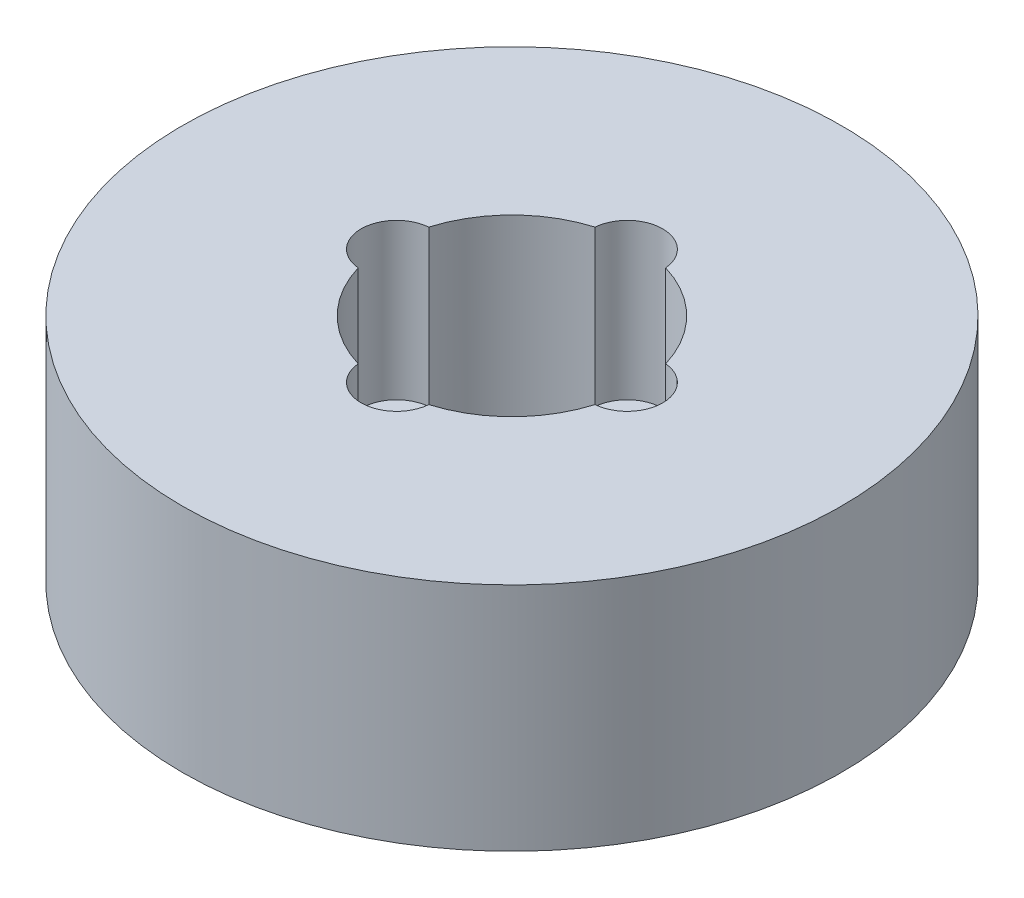
ISO-10303-21;
HEADER;
FILE_DESCRIPTION(('STEP AP214'),'2;1');
FILE_NAME('part.step','',(''),(''),'','','');
FILE_SCHEMA(('AUTOMOTIVE_DESIGN { 1 0 10303 214 1 1 1 1 }'));
ENDSEC;
DATA;
#1=APPLICATION_CONTEXT('core data for automotive mechanical design processes');
#2=APPLICATION_PROTOCOL_DEFINITION('international standard','automotive_design',2000,#1);
#3=PRODUCT_CONTEXT('',#1,'mechanical');
#4=PRODUCT('Part','Part','',(#3));
#5=PRODUCT_RELATED_PRODUCT_CATEGORY('part','',(#4));
#6=PRODUCT_DEFINITION_FORMATION('','',#4);
#7=PRODUCT_DEFINITION_CONTEXT('part definition',#1,'design');
#8=PRODUCT_DEFINITION('design','',#6,#7);
#9=PRODUCT_DEFINITION_SHAPE('','',#8);
#10=(LENGTH_UNIT() NAMED_UNIT(*) SI_UNIT(.MILLI.,.METRE.));
#11=(NAMED_UNIT(*) PLANE_ANGLE_UNIT() SI_UNIT($,.RADIAN.));
#12=(NAMED_UNIT(*) SI_UNIT($,.STERADIAN.) SOLID_ANGLE_UNIT());
#13=UNCERTAINTY_MEASURE_WITH_UNIT(LENGTH_MEASURE(1.E-05),#10,'distance_accuracy_value','');
#14=(GEOMETRIC_REPRESENTATION_CONTEXT(3) GLOBAL_UNCERTAINTY_ASSIGNED_CONTEXT((#13)) GLOBAL_UNIT_ASSIGNED_CONTEXT((#10,
#11,#12)) REPRESENTATION_CONTEXT('',''));
#15=CARTESIAN_POINT('',(0.,0.,0.));
#16=DIRECTION('',(0.,0.,1.));
#17=DIRECTION('',(1.,0.,0.));
#18=AXIS2_PLACEMENT_3D('',#15,#16,#17);
#19=CARTESIAN_POINT('',(0.,14.,0.));
#20=DIRECTION('',(0.,-1.,0.));
#21=DIRECTION('',(0.,0.,-1.));
#22=AXIS2_PLACEMENT_3D('',#19,#20,#21);
#23=CYLINDRICAL_SURFACE('',#22,20.);
#24=CARTESIAN_POINT('',(0.,14.,0.));
#25=DIRECTION('',(0.,1.,0.));
#26=DIRECTION('',(0.,0.,1.));
#27=AXIS2_PLACEMENT_3D('',#24,#25,#26);
#28=CIRCLE('',#27,20.);
#29=CARTESIAN_POINT('',(0.,14.,20.));
#30=VERTEX_POINT('',#29);
#31=EDGE_CURVE('E148',#30,#30,#28,.T.);
#32=ORIENTED_EDGE('',*,*,#31,.F.);
#33=EDGE_LOOP('',(#32));
#34=FACE_BOUND('',#33,.T.);
#35=CARTESIAN_POINT('',(0.,0.,0.));
#36=DIRECTION('',(0.,1.,0.));
#37=DIRECTION('',(0.,0.,1.));
#38=AXIS2_PLACEMENT_3D('',#35,#36,#37);
#39=CIRCLE('',#38,20.);
#40=CARTESIAN_POINT('',(0.,0.,20.));
#41=VERTEX_POINT('',#40);
#42=EDGE_CURVE('E139',#41,#41,#39,.T.);
#43=ORIENTED_EDGE('',*,*,#42,.T.);
#44=EDGE_LOOP('',(#43));
#45=FACE_BOUND('',#44,.T.);
#46=ADVANCED_FACE('F39',(#34,#45),#23,.T.);
#47=CARTESIAN_POINT('',(0.,14.,0.));
#48=DIRECTION('',(0.,1.,0.));
#49=DIRECTION('',(0.,0.,1.));
#50=AXIS2_PLACEMENT_3D('',#47,#48,#49);
#51=PLANE('',#50);
#52=CARTESIAN_POINT('',(0.,14.,6.99809627043051));
#53=DIRECTION('',(0.,1.,0.));
#54=DIRECTION('',(1.,0.,0.));
#55=AXIS2_PLACEMENT_3D('',#52,#53,#54);
#56=CIRCLE('',#55,2.1517957168295);
#57=CARTESIAN_POINT('',(-2.14347216457167,14.,7.18717796354775));
#58=VERTEX_POINT('',#57);
#59=CARTESIAN_POINT('',(2.14347216457172,14.,7.18717796354774));
#60=VERTEX_POINT('',#59);
#61=EDGE_CURVE('E175',#58,#60,#56,.T.);
#62=ORIENTED_EDGE('',*,*,#61,.F.);
#63=CARTESIAN_POINT('',(0.,14.,0.));
#64=DIRECTION('',(0.,1.,0.));
#65=DIRECTION('',(0.,0.,1.));
#66=AXIS2_PLACEMENT_3D('',#63,#64,#65);
#67=CIRCLE('',#66,7.5);
#68=CARTESIAN_POINT('',(-7.18717796354775,14.,2.1434721645717));
#69=VERTEX_POINT('',#68);
#70=EDGE_CURVE('E134',#69,#58,#67,.T.);
#71=ORIENTED_EDGE('',*,*,#70,.F.);
#72=CARTESIAN_POINT('',(-6.99809627043051,14.,0.));
#73=DIRECTION('',(0.,1.,0.));
#74=DIRECTION('',(0.,0.,1.));
#75=AXIS2_PLACEMENT_3D('',#72,#73,#74);
#76=CIRCLE('',#75,2.1517957168295);
#77=CARTESIAN_POINT('',(-7.18717796354775,14.,-2.1434721645717));
#78=VERTEX_POINT('',#77);
#79=EDGE_CURVE('E143',#78,#69,#76,.T.);
#80=ORIENTED_EDGE('',*,*,#79,.F.);
#81=CARTESIAN_POINT('',(-2.14347216457177,14.,-7.18717796354772));
#82=VERTEX_POINT('',#81);
#83=EDGE_CURVE('E123',#82,#78,#67,.T.);
#84=ORIENTED_EDGE('',*,*,#83,.F.);
#85=CARTESIAN_POINT('',(0.,14.,-6.99809627043051));
#86=DIRECTION('',(0.,1.,0.));
#87=DIRECTION('',(-1.,0.,0.));
#88=AXIS2_PLACEMENT_3D('',#85,#86,#87);
#89=CIRCLE('',#88,2.1517957168295);
#90=CARTESIAN_POINT('',(2.14347216457162,14.,-7.18717796354777));
#91=VERTEX_POINT('',#90);
#92=EDGE_CURVE('E106',#91,#82,#89,.T.);
#93=ORIENTED_EDGE('',*,*,#92,.F.);
#94=CARTESIAN_POINT('',(7.18717796354775,14.,-2.1434721645717));
#95=VERTEX_POINT('',#94);
#96=EDGE_CURVE('E125',#95,#91,#67,.T.);
#97=ORIENTED_EDGE('',*,*,#96,.F.);
#98=CARTESIAN_POINT('',(6.99809627043051,14.,0.));
#99=DIRECTION('',(0.,1.,0.));
#100=DIRECTION('',(0.,0.,-1.));
#101=AXIS2_PLACEMENT_3D('',#98,#99,#100);
#102=CIRCLE('',#101,2.1517957168295);
#103=CARTESIAN_POINT('',(7.18717796354775,14.,2.1434721645717));
#104=VERTEX_POINT('',#103);
#105=EDGE_CURVE('E286',#104,#95,#102,.T.);
#106=ORIENTED_EDGE('',*,*,#105,.F.);
#107=EDGE_CURVE('E135',#60,#104,#67,.T.);
#108=ORIENTED_EDGE('',*,*,#107,.F.);
#109=EDGE_LOOP('',(#62,#71,#80,#84,#93,#97,#106,#108));
#110=FACE_BOUND('',#109,.T.);
#111=ORIENTED_EDGE('',*,*,#31,.T.);
#112=EDGE_LOOP('',(#111));
#113=FACE_BOUND('',#112,.T.);
#114=ADVANCED_FACE('F118',(#110,#113),#51,.T.);
#115=CARTESIAN_POINT('',(0.,0.,0.));
#116=DIRECTION('',(0.,1.,0.));
#117=DIRECTION('',(0.,0.,1.));
#118=AXIS2_PLACEMENT_3D('',#115,#116,#117);
#119=PLANE('',#118);
#120=CARTESIAN_POINT('',(0.,0.,0.));
#121=DIRECTION('',(0.,1.,0.));
#122=DIRECTION('',(0.,0.,1.));
#123=AXIS2_PLACEMENT_3D('',#120,#121,#122);
#124=CIRCLE('',#123,7.5);
#125=CARTESIAN_POINT('',(0.,0.,7.5));
#126=VERTEX_POINT('',#125);
#127=EDGE_CURVE('E136',#126,#126,#124,.T.);
#128=ORIENTED_EDGE('',*,*,#127,.T.);
#129=EDGE_LOOP('',(#128));
#130=FACE_BOUND('',#129,.T.);
#131=ORIENTED_EDGE('',*,*,#42,.F.);
#132=EDGE_LOOP('',(#131));
#133=FACE_BOUND('',#132,.T.);
#134=ADVANCED_FACE('F187',(#130,#133),#119,.F.);
#135=CARTESIAN_POINT('',(0.,14.,0.));
#136=DIRECTION('',(0.,-1.,0.));
#137=DIRECTION('',(0.,0.,-1.));
#138=AXIS2_PLACEMENT_3D('',#135,#136,#137);
#139=CYLINDRICAL_SURFACE('',#138,7.5);
#140=DIRECTION('',(0.,1.,0.));
#141=VECTOR('',#140,1.);
#142=CARTESIAN_POINT('',(-2.14347216457167,9.28427016242184,7.18717796354775));
#143=LINE('',#142,#141);
#144=CARTESIAN_POINT('',(-2.14347216457167,4.56854032484368,7.18717796354775));
#145=VERTEX_POINT('',#144);
#146=EDGE_CURVE('E11',#145,#58,#143,.T.);
#147=ORIENTED_EDGE('',*,*,#146,.F.);
#148=CARTESIAN_POINT('',(0.,4.56854032484368,0.));
#149=DIRECTION('',(0.,1.,0.));
#150=DIRECTION('',(0.,0.,1.));
#151=AXIS2_PLACEMENT_3D('',#148,#149,#150);
#152=CIRCLE('',#151,7.5);
#153=CARTESIAN_POINT('',(2.14347216457172,4.56854032484368,7.18717796354774));
#154=VERTEX_POINT('',#153);
#155=EDGE_CURVE('E170',#145,#154,#152,.T.);
#156=ORIENTED_EDGE('',*,*,#155,.T.);
#157=DIRECTION('',(0.,1.,0.));
#158=VECTOR('',#157,1.);
#159=CARTESIAN_POINT('',(2.14347216457172,9.28427016242184,7.18717796354774));
#160=LINE('',#159,#158);
#161=EDGE_CURVE('E46',#60,#154,#160,.F.);
#162=ORIENTED_EDGE('',*,*,#161,.F.);
#163=ORIENTED_EDGE('',*,*,#107,.T.);
#164=DIRECTION('',(0.,1.,0.));
#165=VECTOR('',#164,1.);
#166=CARTESIAN_POINT('',(7.18717796354775,9.28427016242184,2.1434721645717));
#167=LINE('',#166,#165);
#168=CARTESIAN_POINT('',(7.18717796354775,4.56854032484368,2.1434721645717));
#169=VERTEX_POINT('',#168);
#170=EDGE_CURVE('E164',#169,#104,#167,.T.);
#171=ORIENTED_EDGE('',*,*,#170,.F.);
#172=CARTESIAN_POINT('',(0.,4.56854032484368,0.));
#173=DIRECTION('',(0.,1.,0.));
#174=DIRECTION('',(0.,0.,1.));
#175=AXIS2_PLACEMENT_3D('',#172,#173,#174);
#176=CIRCLE('',#175,7.5);
#177=CARTESIAN_POINT('',(7.18717796354775,4.56854032484368,-2.1434721645717));
#178=VERTEX_POINT('',#177);
#179=EDGE_CURVE('E115',#169,#178,#176,.T.);
#180=ORIENTED_EDGE('',*,*,#179,.T.);
#181=DIRECTION('',(0.,1.,0.));
#182=VECTOR('',#181,1.);
#183=CARTESIAN_POINT('',(7.18717796354775,9.28427016242184,-2.1434721645717));
#184=LINE('',#183,#182);
#185=EDGE_CURVE('E131',#95,#178,#184,.F.);
#186=ORIENTED_EDGE('',*,*,#185,.F.);
#187=ORIENTED_EDGE('',*,*,#96,.T.);
#188=DIRECTION('',(0.,1.,0.));
#189=VECTOR('',#188,1.);
#190=CARTESIAN_POINT('',(2.14347216457162,9.28427016242184,-7.18717796354777));
#191=LINE('',#190,#189);
#192=CARTESIAN_POINT('',(2.14347216457162,4.56854032484368,-7.18717796354777));
#193=VERTEX_POINT('',#192);
#194=EDGE_CURVE('E105',#193,#91,#191,.T.);
#195=ORIENTED_EDGE('',*,*,#194,.F.);
#196=CARTESIAN_POINT('',(0.,4.56854032484368,0.));
#197=DIRECTION('',(0.,1.,0.));
#198=DIRECTION('',(0.,0.,1.));
#199=AXIS2_PLACEMENT_3D('',#196,#197,#198);
#200=CIRCLE('',#199,7.5);
#201=CARTESIAN_POINT('',(-2.14347216457177,4.56854032484368,-7.18717796354772));
#202=VERTEX_POINT('',#201);
#203=EDGE_CURVE('E159',#193,#202,#200,.T.);
#204=ORIENTED_EDGE('',*,*,#203,.T.);
#205=DIRECTION('',(0.,1.,0.));
#206=VECTOR('',#205,1.);
#207=CARTESIAN_POINT('',(-2.14347216457177,9.28427016242184,-7.18717796354772));
#208=LINE('',#207,#206);
#209=EDGE_CURVE('E114',#82,#202,#208,.F.);
#210=ORIENTED_EDGE('',*,*,#209,.F.);
#211=ORIENTED_EDGE('',*,*,#83,.T.);
#212=DIRECTION('',(0.,1.,0.));
#213=VECTOR('',#212,1.);
#214=CARTESIAN_POINT('',(-7.18717796354775,9.28427016242184,-2.1434721645717));
#215=LINE('',#214,#213);
#216=CARTESIAN_POINT('',(-7.18717796354775,4.56854032484368,-2.1434721645717));
#217=VERTEX_POINT('',#216);
#218=EDGE_CURVE('E160',#217,#78,#215,.T.);
#219=ORIENTED_EDGE('',*,*,#218,.F.);
#220=CARTESIAN_POINT('',(0.,4.56854032484368,0.));
#221=DIRECTION('',(0.,1.,0.));
#222=DIRECTION('',(0.,0.,1.));
#223=AXIS2_PLACEMENT_3D('',#220,#221,#222);
#224=CIRCLE('',#223,7.5);
#225=CARTESIAN_POINT('',(-7.18717796354775,4.56854032484368,2.1434721645717));
#226=VERTEX_POINT('',#225);
#227=EDGE_CURVE('E149',#217,#226,#224,.T.);
#228=ORIENTED_EDGE('',*,*,#227,.T.);
#229=DIRECTION('',(0.,1.,0.));
#230=VECTOR('',#229,1.);
#231=CARTESIAN_POINT('',(-7.18717796354775,9.28427016242184,2.1434721645717));
#232=LINE('',#231,#230);
#233=EDGE_CURVE('E152',#69,#226,#232,.F.);
#234=ORIENTED_EDGE('',*,*,#233,.F.);
#235=ORIENTED_EDGE('',*,*,#70,.T.);
#236=EDGE_LOOP('',(#147,#156,#162,#163,#171,#180,#186,#187,#195,#204,#210,#211,#219,#228,#234,#235));
#237=FACE_BOUND('',#236,.T.);
#238=ORIENTED_EDGE('',*,*,#127,.F.);
#239=EDGE_LOOP('',(#238));
#240=FACE_BOUND('',#239,.T.);
#241=ADVANCED_FACE('F126',(#237,#240),#139,.F.);
#242=CARTESIAN_POINT('',(-6.99809627043051,4.56854032484368,0.));
#243=DIRECTION('',(0.,1.,0.));
#244=DIRECTION('',(0.,0.,1.));
#245=AXIS2_PLACEMENT_3D('',#242,#243,#244);
#246=CYLINDRICAL_SURFACE('',#245,2.1517957168295);
#247=ORIENTED_EDGE('',*,*,#218,.T.);
#248=ORIENTED_EDGE('',*,*,#79,.T.);
#249=ORIENTED_EDGE('',*,*,#233,.T.);
#250=CARTESIAN_POINT('',(-6.99809627043051,4.56854032484368,0.));
#251=DIRECTION('',(0.,1.,0.));
#252=DIRECTION('',(0.,0.,1.));
#253=AXIS2_PLACEMENT_3D('',#250,#251,#252);
#254=CIRCLE('',#253,2.1517957168295);
#255=EDGE_CURVE('E144',#217,#226,#254,.T.);
#256=ORIENTED_EDGE('',*,*,#255,.F.);
#257=EDGE_LOOP('',(#247,#248,#249,#256));
#258=FACE_BOUND('',#257,.T.);
#259=ADVANCED_FACE('F200',(#258),#246,.F.);
#260=CARTESIAN_POINT('',(-6.99809627043051,4.56854032484368,0.));
#261=DIRECTION('',(0.,1.,0.));
#262=DIRECTION('',(0.,0.,1.));
#263=AXIS2_PLACEMENT_3D('',#260,#261,#262);
#264=PLANE('',#263);
#265=ORIENTED_EDGE('',*,*,#255,.T.);
#266=ORIENTED_EDGE('',*,*,#227,.F.);
#267=EDGE_LOOP('',(#265,#266));
#268=FACE_BOUND('',#267,.T.);
#269=ADVANCED_FACE('F201',(#268),#264,.T.);
#270=CARTESIAN_POINT('',(0.,4.56854032484368,-6.99809627043051));
#271=DIRECTION('',(0.,1.,0.));
#272=DIRECTION('',(0.,0.,1.));
#273=AXIS2_PLACEMENT_3D('',#270,#271,#272);
#274=CYLINDRICAL_SURFACE('',#273,2.1517957168295);
#275=ORIENTED_EDGE('',*,*,#194,.T.);
#276=ORIENTED_EDGE('',*,*,#92,.T.);
#277=ORIENTED_EDGE('',*,*,#209,.T.);
#278=CARTESIAN_POINT('',(0.,4.56854032484368,-6.99809627043051));
#279=DIRECTION('',(0.,1.,0.));
#280=DIRECTION('',(-1.,0.,0.));
#281=AXIS2_PLACEMENT_3D('',#278,#279,#280);
#282=CIRCLE('',#281,2.1517957168295);
#283=EDGE_CURVE('E107',#193,#202,#282,.T.);
#284=ORIENTED_EDGE('',*,*,#283,.F.);
#285=EDGE_LOOP('',(#275,#276,#277,#284));
#286=FACE_BOUND('',#285,.T.);
#287=ADVANCED_FACE('F102',(#286),#274,.F.);
#288=CARTESIAN_POINT('',(0.,4.56854032484368,-6.99809627043051));
#289=DIRECTION('',(0.,1.,0.));
#290=DIRECTION('',(-1.,0.,0.));
#291=AXIS2_PLACEMENT_3D('',#288,#289,#290);
#292=PLANE('',#291);
#293=ORIENTED_EDGE('',*,*,#283,.T.);
#294=ORIENTED_EDGE('',*,*,#203,.F.);
#295=EDGE_LOOP('',(#293,#294));
#296=FACE_BOUND('',#295,.T.);
#297=ADVANCED_FACE('F209',(#296),#292,.T.);
#298=CARTESIAN_POINT('',(6.99809627043051,4.56854032484368,0.));
#299=DIRECTION('',(0.,1.,0.));
#300=DIRECTION('',(0.,0.,1.));
#301=AXIS2_PLACEMENT_3D('',#298,#299,#300);
#302=CYLINDRICAL_SURFACE('',#301,2.1517957168295);
#303=ORIENTED_EDGE('',*,*,#170,.T.);
#304=ORIENTED_EDGE('',*,*,#105,.T.);
#305=ORIENTED_EDGE('',*,*,#185,.T.);
#306=CARTESIAN_POINT('',(6.99809627043051,4.56854032484368,0.));
#307=DIRECTION('',(0.,1.,0.));
#308=DIRECTION('',(0.,0.,-1.));
#309=AXIS2_PLACEMENT_3D('',#306,#307,#308);
#310=CIRCLE('',#309,2.1517957168295);
#311=EDGE_CURVE('E56',#169,#178,#310,.T.);
#312=ORIENTED_EDGE('',*,*,#311,.F.);
#313=EDGE_LOOP('',(#303,#304,#305,#312));
#314=FACE_BOUND('',#313,.T.);
#315=ADVANCED_FACE('F213',(#314),#302,.F.);
#316=CARTESIAN_POINT('',(6.99809627043051,4.56854032484368,0.));
#317=DIRECTION('',(0.,1.,0.));
#318=DIRECTION('',(0.,0.,-1.));
#319=AXIS2_PLACEMENT_3D('',#316,#317,#318);
#320=PLANE('',#319);
#321=ORIENTED_EDGE('',*,*,#311,.T.);
#322=ORIENTED_EDGE('',*,*,#179,.F.);
#323=EDGE_LOOP('',(#321,#322));
#324=FACE_BOUND('',#323,.T.);
#325=ADVANCED_FACE('F179',(#324),#320,.T.);
#326=CARTESIAN_POINT('',(0.,4.56854032484368,6.99809627043051));
#327=DIRECTION('',(0.,1.,0.));
#328=DIRECTION('',(0.,0.,1.));
#329=AXIS2_PLACEMENT_3D('',#326,#327,#328);
#330=CYLINDRICAL_SURFACE('',#329,2.1517957168295);
#331=ORIENTED_EDGE('',*,*,#146,.T.);
#332=ORIENTED_EDGE('',*,*,#61,.T.);
#333=ORIENTED_EDGE('',*,*,#161,.T.);
#334=CARTESIAN_POINT('',(0.,4.56854032484368,6.99809627043051));
#335=DIRECTION('',(0.,1.,0.));
#336=DIRECTION('',(1.,0.,0.));
#337=AXIS2_PLACEMENT_3D('',#334,#335,#336);
#338=CIRCLE('',#337,2.1517957168295);
#339=EDGE_CURVE('E55',#145,#154,#338,.T.);
#340=ORIENTED_EDGE('',*,*,#339,.F.);
#341=EDGE_LOOP('',(#331,#332,#333,#340));
#342=FACE_BOUND('',#341,.T.);
#343=ADVANCED_FACE('F171',(#342),#330,.F.);
#344=CARTESIAN_POINT('',(0.,4.56854032484368,6.99809627043051));
#345=DIRECTION('',(0.,1.,0.));
#346=DIRECTION('',(1.,0.,0.));
#347=AXIS2_PLACEMENT_3D('',#344,#345,#346);
#348=PLANE('',#347);
#349=ORIENTED_EDGE('',*,*,#339,.T.);
#350=ORIENTED_EDGE('',*,*,#155,.F.);
#351=EDGE_LOOP('',(#349,#350));
#352=FACE_BOUND('',#351,.T.);
#353=ADVANCED_FACE('F173',(#352),#348,.T.);
#354=CLOSED_SHELL('',(#46,#114,#134,#241,#259,#269,#287,#297,#315,#325,#343,#353));
#355=MANIFOLD_SOLID_BREP('B2',#354);
#356=ADVANCED_BREP_SHAPE_REPRESENTATION('',(#18,#355),#14);
#357=SHAPE_DEFINITION_REPRESENTATION(#9,#356);
ENDSEC;
END-ISO-10303-21;
